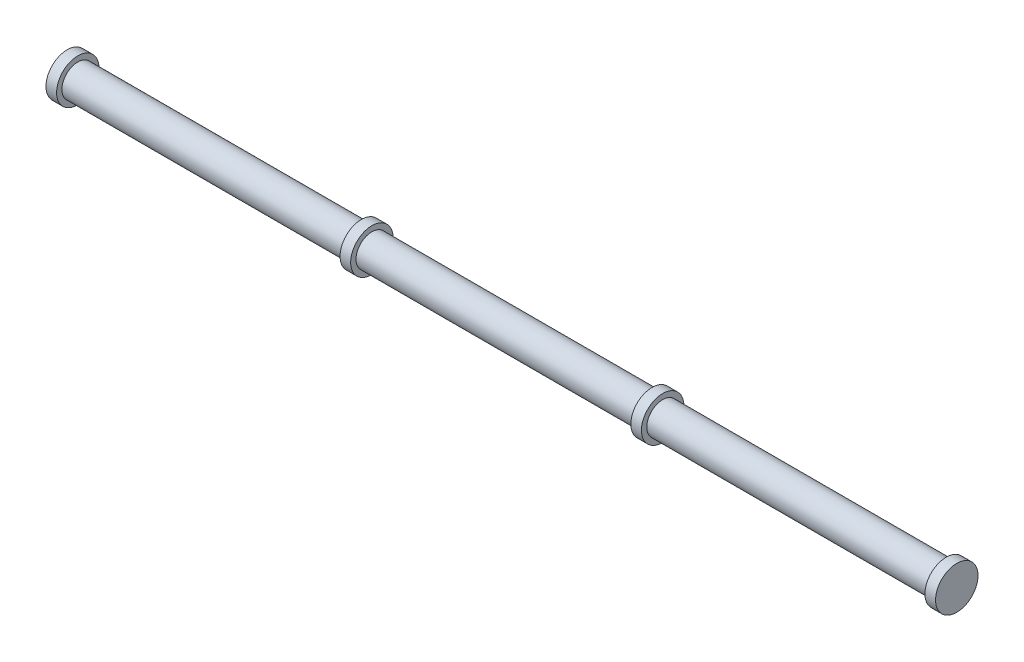
ISO-10303-21;
HEADER;
FILE_DESCRIPTION(('STEP AP214'),'2;1');
FILE_NAME('part.step','',(''),(''),'','','');
FILE_SCHEMA(('AUTOMOTIVE_DESIGN { 1 0 10303 214 1 1 1 1 }'));
ENDSEC;
DATA;
#1=APPLICATION_CONTEXT('core data for automotive mechanical design processes');
#2=APPLICATION_PROTOCOL_DEFINITION('international standard','automotive_design',2000,#1);
#3=PRODUCT_CONTEXT('',#1,'mechanical');
#4=PRODUCT('Part','Part','',(#3));
#5=PRODUCT_RELATED_PRODUCT_CATEGORY('part','',(#4));
#6=PRODUCT_DEFINITION_FORMATION('','',#4);
#7=PRODUCT_DEFINITION_CONTEXT('part definition',#1,'design');
#8=PRODUCT_DEFINITION('design','',#6,#7);
#9=PRODUCT_DEFINITION_SHAPE('','',#8);
#10=(LENGTH_UNIT() NAMED_UNIT(*) SI_UNIT(.MILLI.,.METRE.));
#11=(NAMED_UNIT(*) PLANE_ANGLE_UNIT() SI_UNIT($,.RADIAN.));
#12=(NAMED_UNIT(*) SI_UNIT($,.STERADIAN.) SOLID_ANGLE_UNIT());
#13=UNCERTAINTY_MEASURE_WITH_UNIT(LENGTH_MEASURE(1.E-05),#10,'distance_accuracy_value','');
#14=(GEOMETRIC_REPRESENTATION_CONTEXT(3) GLOBAL_UNCERTAINTY_ASSIGNED_CONTEXT((#13)) GLOBAL_UNIT_ASSIGNED_CONTEXT((#10,
#11,#12)) REPRESENTATION_CONTEXT('',''));
#15=CARTESIAN_POINT('',(0.,0.,0.));
#16=DIRECTION('',(0.,0.,1.));
#17=DIRECTION('',(1.,0.,0.));
#18=AXIS2_PLACEMENT_3D('',#15,#16,#17);
#19=CARTESIAN_POINT('',(204.47,0.,0.));
#20=DIRECTION('',(-1.,0.,0.));
#21=DIRECTION('',(0.,0.,1.));
#22=AXIS2_PLACEMENT_3D('',#19,#20,#21);
#23=CYLINDRICAL_SURFACE('',#22,7.5);
#24=CARTESIAN_POINT('',(65.969999966,0.,0.));
#25=DIRECTION('',(-1.,0.,0.));
#26=DIRECTION('',(0.,0.,1.));
#27=AXIS2_PLACEMENT_3D('',#24,#25,#26);
#28=CIRCLE('',#27,7.5);
#29=CARTESIAN_POINT('',(65.969999966,0.,7.5));
#30=VERTEX_POINT('',#29);
#31=EDGE_CURVE('E45',#30,#30,#28,.T.);
#32=ORIENTED_EDGE('',*,*,#31,.T.);
#33=EDGE_LOOP('',(#32));
#34=FACE_BOUND('',#33,.T.);
#35=CARTESIAN_POINT('',(-65.969999966,0.,0.));
#36=DIRECTION('',(1.,0.,0.));
#37=DIRECTION('',(0.,0.,-1.));
#38=AXIS2_PLACEMENT_3D('',#35,#36,#37);
#39=CIRCLE('',#38,7.5);
#40=CARTESIAN_POINT('',(-65.969999966,0.,-7.5));
#41=VERTEX_POINT('',#40);
#42=EDGE_CURVE('E58',#41,#41,#39,.T.);
#43=ORIENTED_EDGE('',*,*,#42,.T.);
#44=EDGE_LOOP('',(#43));
#45=FACE_BOUND('',#44,.T.);
#46=ADVANCED_FACE('F41',(#34,#45),#23,.T.);
#47=CARTESIAN_POINT('',(-65.969999966,0.,0.));
#48=DIRECTION('',(-1.,0.,0.));
#49=DIRECTION('',(0.,0.,1.));
#50=AXIS2_PLACEMENT_3D('',#47,#48,#49);
#51=CYLINDRICAL_SURFACE('',#50,10.);
#52=CARTESIAN_POINT('',(-65.969999966,0.,0.));
#53=DIRECTION('',(1.,0.,0.));
#54=DIRECTION('',(0.,0.,-1.));
#55=AXIS2_PLACEMENT_3D('',#52,#53,#54);
#56=CIRCLE('',#55,10.);
#57=CARTESIAN_POINT('',(-65.969999966,0.,-10.));
#58=VERTEX_POINT('',#57);
#59=EDGE_CURVE('E62',#58,#58,#56,.T.);
#60=ORIENTED_EDGE('',*,*,#59,.F.);
#61=EDGE_LOOP('',(#60));
#62=FACE_BOUND('',#61,.T.);
#63=CARTESIAN_POINT('',(-70.969999966,0.,0.));
#64=DIRECTION('',(1.,0.,0.));
#65=DIRECTION('',(0.,0.,-1.));
#66=AXIS2_PLACEMENT_3D('',#63,#64,#65);
#67=CIRCLE('',#66,10.);
#68=CARTESIAN_POINT('',(-70.969999966,0.,-10.));
#69=VERTEX_POINT('',#68);
#70=EDGE_CURVE('E86',#69,#69,#67,.T.);
#71=ORIENTED_EDGE('',*,*,#70,.T.);
#72=EDGE_LOOP('',(#71));
#73=FACE_BOUND('',#72,.T.);
#74=ADVANCED_FACE('F123',(#62,#73),#51,.T.);
#75=CARTESIAN_POINT('',(-65.969999966,0.,0.));
#76=DIRECTION('',(1.,0.,0.));
#77=DIRECTION('',(0.,0.,-1.));
#78=AXIS2_PLACEMENT_3D('',#75,#76,#77);
#79=PLANE('',#78);
#80=ORIENTED_EDGE('',*,*,#42,.F.);
#81=EDGE_LOOP('',(#80));
#82=FACE_BOUND('',#81,.T.);
#83=ORIENTED_EDGE('',*,*,#59,.T.);
#84=EDGE_LOOP('',(#83));
#85=FACE_BOUND('',#84,.T.);
#86=ADVANCED_FACE('F129',(#82,#85),#79,.T.);
#87=CARTESIAN_POINT('',(-70.969999966,0.,0.));
#88=DIRECTION('',(1.,0.,0.));
#89=DIRECTION('',(0.,0.,-1.));
#90=AXIS2_PLACEMENT_3D('',#87,#88,#89);
#91=PLANE('',#90);
#92=CARTESIAN_POINT('',(-70.969999966,0.,0.));
#93=DIRECTION('',(1.,0.,0.));
#94=DIRECTION('',(0.,0.,-1.));
#95=AXIS2_PLACEMENT_3D('',#92,#93,#94);
#96=CIRCLE('',#95,7.5);
#97=CARTESIAN_POINT('',(-70.969999966,0.,-7.5));
#98=VERTEX_POINT('',#97);
#99=EDGE_CURVE('E50',#98,#98,#96,.T.);
#100=ORIENTED_EDGE('',*,*,#99,.T.);
#101=EDGE_LOOP('',(#100));
#102=FACE_BOUND('',#101,.T.);
#103=ORIENTED_EDGE('',*,*,#70,.F.);
#104=EDGE_LOOP('',(#103));
#105=FACE_BOUND('',#104,.T.);
#106=ADVANCED_FACE('F147',(#102,#105),#91,.F.);
#107=CARTESIAN_POINT('',(-209.47,0.,0.));
#108=DIRECTION('',(-1.,0.,0.));
#109=DIRECTION('',(0.,0.,-1.));
#110=AXIS2_PLACEMENT_3D('',#107,#108,#109);
#111=PLANE('',#110);
#112=CARTESIAN_POINT('',(-209.47,0.,0.));
#113=DIRECTION('',(1.,0.,0.));
#114=DIRECTION('',(0.,0.,-1.));
#115=AXIS2_PLACEMENT_3D('',#112,#113,#114);
#116=CIRCLE('',#115,10.);
#117=CARTESIAN_POINT('',(-209.47,0.,-10.));
#118=VERTEX_POINT('',#117);
#119=EDGE_CURVE('E68',#118,#118,#116,.T.);
#120=ORIENTED_EDGE('',*,*,#119,.F.);
#121=EDGE_LOOP('',(#120));
#122=FACE_BOUND('',#121,.T.);
#123=ADVANCED_FACE('F150',(#122),#111,.T.);
#124=CARTESIAN_POINT('',(-209.47,0.,0.));
#125=DIRECTION('',(1.,0.,0.));
#126=DIRECTION('',(0.,0.,1.));
#127=AXIS2_PLACEMENT_3D('',#124,#125,#126);
#128=CYLINDRICAL_SURFACE('',#127,10.);
#129=ORIENTED_EDGE('',*,*,#119,.T.);
#130=EDGE_LOOP('',(#129));
#131=FACE_BOUND('',#130,.T.);
#132=CARTESIAN_POINT('',(-204.47,0.,0.));
#133=DIRECTION('',(1.,0.,0.));
#134=DIRECTION('',(0.,0.,-1.));
#135=AXIS2_PLACEMENT_3D('',#132,#133,#134);
#136=CIRCLE('',#135,10.);
#137=CARTESIAN_POINT('',(-204.47,0.,-10.));
#138=VERTEX_POINT('',#137);
#139=EDGE_CURVE('E64',#138,#138,#136,.T.);
#140=ORIENTED_EDGE('',*,*,#139,.F.);
#141=EDGE_LOOP('',(#140));
#142=FACE_BOUND('',#141,.T.);
#143=ADVANCED_FACE('F43',(#131,#142),#128,.T.);
#144=CARTESIAN_POINT('',(-204.47,0.,0.));
#145=DIRECTION('',(-1.,0.,0.));
#146=DIRECTION('',(0.,0.,-1.));
#147=AXIS2_PLACEMENT_3D('',#144,#145,#146);
#148=PLANE('',#147);
#149=CARTESIAN_POINT('',(-204.47,0.,0.));
#150=DIRECTION('',(1.,0.,0.));
#151=DIRECTION('',(0.,0.,-1.));
#152=AXIS2_PLACEMENT_3D('',#149,#150,#151);
#153=CIRCLE('',#152,7.5);
#154=CARTESIAN_POINT('',(-204.47,0.,-7.5));
#155=VERTEX_POINT('',#154);
#156=EDGE_CURVE('E55',#155,#155,#153,.T.);
#157=ORIENTED_EDGE('',*,*,#156,.F.);
#158=EDGE_LOOP('',(#157));
#159=FACE_BOUND('',#158,.T.);
#160=ORIENTED_EDGE('',*,*,#139,.T.);
#161=EDGE_LOOP('',(#160));
#162=FACE_BOUND('',#161,.T.);
#163=ADVANCED_FACE('F137',(#159,#162),#148,.F.);
#164=ORIENTED_EDGE('',*,*,#156,.T.);
#165=EDGE_LOOP('',(#164));
#166=FACE_BOUND('',#165,.T.);
#167=ORIENTED_EDGE('',*,*,#99,.F.);
#168=EDGE_LOOP('',(#167));
#169=FACE_BOUND('',#168,.T.);
#170=ADVANCED_FACE('F119',(#166,#169),#23,.T.);
#171=CARTESIAN_POINT('',(65.969999966,0.,0.));
#172=DIRECTION('',(1.,0.,0.));
#173=DIRECTION('',(0.,0.,-1.));
#174=AXIS2_PLACEMENT_3D('',#171,#172,#173);
#175=CYLINDRICAL_SURFACE('',#174,10.);
#176=CARTESIAN_POINT('',(65.969999966,0.,0.));
#177=DIRECTION('',(-1.,0.,0.));
#178=DIRECTION('',(0.,0.,1.));
#179=AXIS2_PLACEMENT_3D('',#176,#177,#178);
#180=CIRCLE('',#179,10.);
#181=CARTESIAN_POINT('',(65.969999966,0.,10.));
#182=VERTEX_POINT('',#181);
#183=EDGE_CURVE('E97',#182,#182,#180,.T.);
#184=ORIENTED_EDGE('',*,*,#183,.F.);
#185=EDGE_LOOP('',(#184));
#186=FACE_BOUND('',#185,.T.);
#187=CARTESIAN_POINT('',(70.969999966,0.,0.));
#188=DIRECTION('',(-1.,0.,0.));
#189=DIRECTION('',(0.,0.,1.));
#190=AXIS2_PLACEMENT_3D('',#187,#188,#189);
#191=CIRCLE('',#190,10.);
#192=CARTESIAN_POINT('',(70.969999966,0.,10.));
#193=VERTEX_POINT('',#192);
#194=EDGE_CURVE('E93',#193,#193,#191,.T.);
#195=ORIENTED_EDGE('',*,*,#194,.T.);
#196=EDGE_LOOP('',(#195));
#197=FACE_BOUND('',#196,.T.);
#198=ADVANCED_FACE('F111',(#186,#197),#175,.T.);
#199=CARTESIAN_POINT('',(65.969999966,0.,0.));
#200=DIRECTION('',(-1.,0.,0.));
#201=DIRECTION('',(0.,0.,1.));
#202=AXIS2_PLACEMENT_3D('',#199,#200,#201);
#203=PLANE('',#202);
#204=ORIENTED_EDGE('',*,*,#31,.F.);
#205=EDGE_LOOP('',(#204));
#206=FACE_BOUND('',#205,.T.);
#207=ORIENTED_EDGE('',*,*,#183,.T.);
#208=EDGE_LOOP('',(#207));
#209=FACE_BOUND('',#208,.T.);
#210=ADVANCED_FACE('F108',(#206,#209),#203,.T.);
#211=CARTESIAN_POINT('',(70.969999966,0.,0.));
#212=DIRECTION('',(-1.,0.,0.));
#213=DIRECTION('',(0.,0.,1.));
#214=AXIS2_PLACEMENT_3D('',#211,#212,#213);
#215=PLANE('',#214);
#216=CARTESIAN_POINT('',(70.969999966,0.,0.));
#217=DIRECTION('',(-1.,0.,0.));
#218=DIRECTION('',(0.,0.,1.));
#219=AXIS2_PLACEMENT_3D('',#216,#217,#218);
#220=CIRCLE('',#219,7.5);
#221=CARTESIAN_POINT('',(70.969999966,0.,7.5));
#222=VERTEX_POINT('',#221);
#223=EDGE_CURVE('E10',#222,#222,#220,.T.);
#224=ORIENTED_EDGE('',*,*,#223,.T.);
#225=EDGE_LOOP('',(#224));
#226=FACE_BOUND('',#225,.T.);
#227=ORIENTED_EDGE('',*,*,#194,.F.);
#228=EDGE_LOOP('',(#227));
#229=FACE_BOUND('',#228,.T.);
#230=ADVANCED_FACE('F110',(#226,#229),#215,.F.);
#231=CARTESIAN_POINT('',(209.47,0.,0.));
#232=DIRECTION('',(1.,0.,0.));
#233=DIRECTION('',(0.,0.,-1.));
#234=AXIS2_PLACEMENT_3D('',#231,#232,#233);
#235=PLANE('',#234);
#236=CARTESIAN_POINT('',(209.47,0.,0.));
#237=DIRECTION('',(1.,0.,0.));
#238=DIRECTION('',(0.,0.,-1.));
#239=AXIS2_PLACEMENT_3D('',#236,#237,#238);
#240=CIRCLE('',#239,10.);
#241=CARTESIAN_POINT('',(209.47,0.,-10.));
#242=VERTEX_POINT('',#241);
#243=EDGE_CURVE('E69',#242,#242,#240,.T.);
#244=ORIENTED_EDGE('',*,*,#243,.T.);
#245=EDGE_LOOP('',(#244));
#246=FACE_BOUND('',#245,.T.);
#247=ADVANCED_FACE('F117',(#246),#235,.T.);
#248=CARTESIAN_POINT('',(209.47,0.,0.));
#249=DIRECTION('',(-1.,0.,0.));
#250=DIRECTION('',(0.,0.,1.));
#251=AXIS2_PLACEMENT_3D('',#248,#249,#250);
#252=CYLINDRICAL_SURFACE('',#251,10.);
#253=ORIENTED_EDGE('',*,*,#243,.F.);
#254=EDGE_LOOP('',(#253));
#255=FACE_BOUND('',#254,.T.);
#256=CARTESIAN_POINT('',(204.47,0.,0.));
#257=DIRECTION('',(1.,0.,0.));
#258=DIRECTION('',(0.,0.,-1.));
#259=AXIS2_PLACEMENT_3D('',#256,#257,#258);
#260=CIRCLE('',#259,10.);
#261=CARTESIAN_POINT('',(204.47,0.,-10.));
#262=VERTEX_POINT('',#261);
#263=EDGE_CURVE('E73',#262,#262,#260,.T.);
#264=ORIENTED_EDGE('',*,*,#263,.T.);
#265=EDGE_LOOP('',(#264));
#266=FACE_BOUND('',#265,.T.);
#267=ADVANCED_FACE('F182',(#255,#266),#252,.T.);
#268=CARTESIAN_POINT('',(204.47,0.,0.));
#269=DIRECTION('',(1.,0.,0.));
#270=DIRECTION('',(0.,0.,-1.));
#271=AXIS2_PLACEMENT_3D('',#268,#269,#270);
#272=PLANE('',#271);
#273=CARTESIAN_POINT('',(204.47,0.,0.));
#274=DIRECTION('',(1.,0.,0.));
#275=DIRECTION('',(0.,0.,-1.));
#276=AXIS2_PLACEMENT_3D('',#273,#274,#275);
#277=CIRCLE('',#276,7.5);
#278=CARTESIAN_POINT('',(204.47,0.,-7.5));
#279=VERTEX_POINT('',#278);
#280=EDGE_CURVE('E61',#279,#279,#277,.T.);
#281=ORIENTED_EDGE('',*,*,#280,.T.);
#282=EDGE_LOOP('',(#281));
#283=FACE_BOUND('',#282,.T.);
#284=ORIENTED_EDGE('',*,*,#263,.F.);
#285=EDGE_LOOP('',(#284));
#286=FACE_BOUND('',#285,.T.);
#287=ADVANCED_FACE('F134',(#283,#286),#272,.F.);
#288=ORIENTED_EDGE('',*,*,#280,.F.);
#289=EDGE_LOOP('',(#288));
#290=FACE_BOUND('',#289,.T.);
#291=ORIENTED_EDGE('',*,*,#223,.F.);
#292=EDGE_LOOP('',(#291));
#293=FACE_BOUND('',#292,.T.);
#294=ADVANCED_FACE('F125',(#290,#293),#23,.T.);
#295=CLOSED_SHELL('',(#46,#74,#86,#106,#123,#143,#163,#170,#198,#210,#230,#247,#267,#287,#294));
#296=MANIFOLD_SOLID_BREP('B2',#295);
#297=ADVANCED_BREP_SHAPE_REPRESENTATION('',(#18,#296),#14);
#298=SHAPE_DEFINITION_REPRESENTATION(#9,#297);
ENDSEC;
END-ISO-10303-21;
